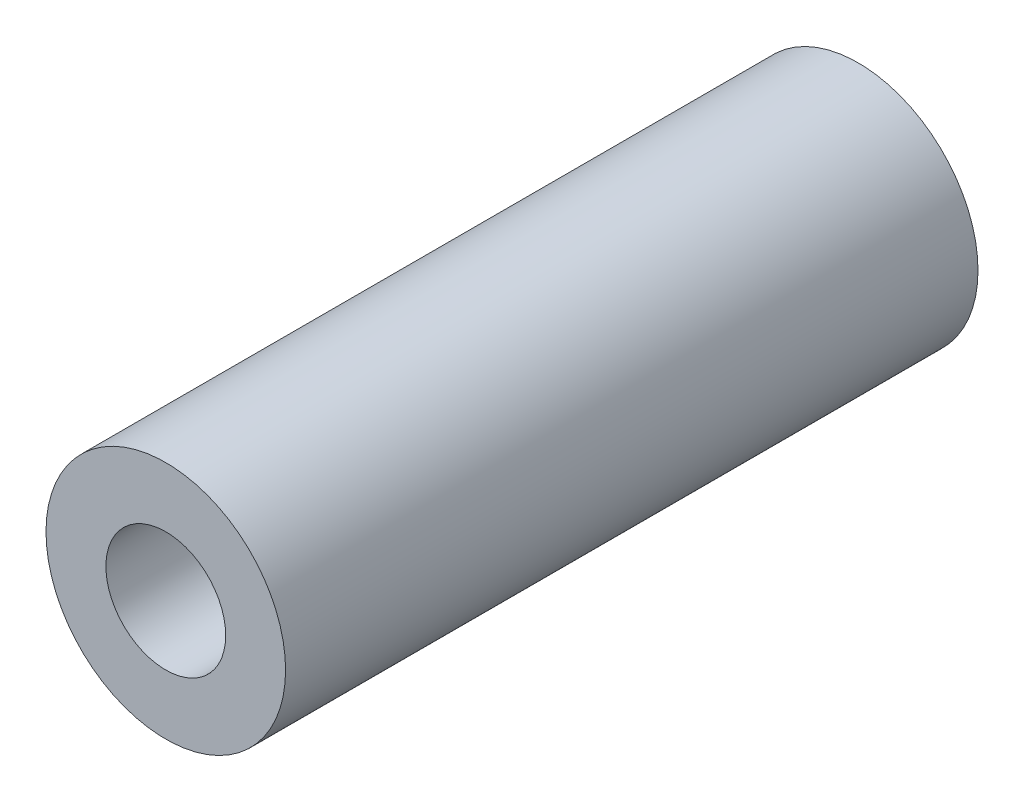
ISO-10303-21;
HEADER;
FILE_DESCRIPTION(('STEP AP214'),'2;1');
FILE_NAME('part.step','',(''),(''),'','','');
FILE_SCHEMA(('AUTOMOTIVE_DESIGN { 1 0 10303 214 1 1 1 1 }'));
ENDSEC;
DATA;
#1=APPLICATION_CONTEXT('core data for automotive mechanical design processes');
#2=APPLICATION_PROTOCOL_DEFINITION('international standard','automotive_design',2000,#1);
#3=PRODUCT_CONTEXT('',#1,'mechanical');
#4=PRODUCT('Part','Part','',(#3));
#5=PRODUCT_RELATED_PRODUCT_CATEGORY('part','',(#4));
#6=PRODUCT_DEFINITION_FORMATION('','',#4);
#7=PRODUCT_DEFINITION_CONTEXT('part definition',#1,'design');
#8=PRODUCT_DEFINITION('design','',#6,#7);
#9=PRODUCT_DEFINITION_SHAPE('','',#8);
#10=(LENGTH_UNIT() NAMED_UNIT(*) SI_UNIT(.MILLI.,.METRE.));
#11=(NAMED_UNIT(*) PLANE_ANGLE_UNIT() SI_UNIT($,.RADIAN.));
#12=(NAMED_UNIT(*) SI_UNIT($,.STERADIAN.) SOLID_ANGLE_UNIT());
#13=UNCERTAINTY_MEASURE_WITH_UNIT(LENGTH_MEASURE(1.E-05),#10,'distance_accuracy_value','');
#14=(GEOMETRIC_REPRESENTATION_CONTEXT(3) GLOBAL_UNCERTAINTY_ASSIGNED_CONTEXT((#13)) GLOBAL_UNIT_ASSIGNED_CONTEXT((#10,
#11,#12)) REPRESENTATION_CONTEXT('',''));
#15=CARTESIAN_POINT('',(0.,0.,0.));
#16=DIRECTION('',(0.,0.,1.));
#17=DIRECTION('',(1.,0.,0.));
#18=AXIS2_PLACEMENT_3D('',#15,#16,#17);
#19=CARTESIAN_POINT('',(0.,0.,28.9));
#20=DIRECTION('',(0.,0.,-1.));
#21=DIRECTION('',(-1.,0.,0.));
#22=AXIS2_PLACEMENT_3D('',#19,#20,#21);
#23=CYLINDRICAL_SURFACE('',#22,5.);
#24=CARTESIAN_POINT('',(0.,0.,28.9));
#25=DIRECTION('',(0.,0.,1.));
#26=DIRECTION('',(1.,0.,0.));
#27=AXIS2_PLACEMENT_3D('',#24,#25,#26);
#28=CIRCLE('',#27,5.);
#29=CARTESIAN_POINT('',(5.,0.,28.9));
#30=VERTEX_POINT('',#29);
#31=EDGE_CURVE('E10',#30,#30,#28,.T.);
#32=ORIENTED_EDGE('',*,*,#31,.F.);
#33=EDGE_LOOP('',(#32));
#34=FACE_BOUND('',#33,.T.);
#35=CARTESIAN_POINT('',(0.,0.,0.));
#36=DIRECTION('',(0.,0.,1.));
#37=DIRECTION('',(1.,0.,0.));
#38=AXIS2_PLACEMENT_3D('',#35,#36,#37);
#39=CIRCLE('',#38,5.);
#40=CARTESIAN_POINT('',(5.,0.,0.));
#41=VERTEX_POINT('',#40);
#42=EDGE_CURVE('E38',#41,#41,#39,.T.);
#43=ORIENTED_EDGE('',*,*,#42,.T.);
#44=EDGE_LOOP('',(#43));
#45=FACE_BOUND('',#44,.T.);
#46=ADVANCED_FACE('F35',(#34,#45),#23,.T.);
#47=CARTESIAN_POINT('',(0.,0.,28.9));
#48=DIRECTION('',(0.,0.,1.));
#49=DIRECTION('',(1.,0.,0.));
#50=AXIS2_PLACEMENT_3D('',#47,#48,#49);
#51=PLANE('',#50);
#52=CARTESIAN_POINT('',(0.,0.,28.9));
#53=DIRECTION('',(0.,0.,1.));
#54=DIRECTION('',(1.,0.,0.));
#55=AXIS2_PLACEMENT_3D('',#52,#53,#54);
#56=CIRCLE('',#55,2.5);
#57=CARTESIAN_POINT('',(2.5,0.,28.9));
#58=VERTEX_POINT('',#57);
#59=EDGE_CURVE('E49',#58,#58,#56,.T.);
#60=ORIENTED_EDGE('',*,*,#59,.F.);
#61=EDGE_LOOP('',(#60));
#62=FACE_BOUND('',#61,.T.);
#63=ORIENTED_EDGE('',*,*,#31,.T.);
#64=EDGE_LOOP('',(#63));
#65=FACE_BOUND('',#64,.T.);
#66=ADVANCED_FACE('F55',(#62,#65),#51,.T.);
#67=CARTESIAN_POINT('',(0.,0.,0.));
#68=DIRECTION('',(0.,0.,1.));
#69=DIRECTION('',(1.,0.,0.));
#70=AXIS2_PLACEMENT_3D('',#67,#68,#69);
#71=PLANE('',#70);
#72=CARTESIAN_POINT('',(0.,0.,0.));
#73=DIRECTION('',(0.,0.,1.));
#74=DIRECTION('',(1.,0.,0.));
#75=AXIS2_PLACEMENT_3D('',#72,#73,#74);
#76=CIRCLE('',#75,2.5);
#77=CARTESIAN_POINT('',(2.5,0.,0.));
#78=VERTEX_POINT('',#77);
#79=EDGE_CURVE('E45',#78,#78,#76,.T.);
#80=ORIENTED_EDGE('',*,*,#79,.T.);
#81=EDGE_LOOP('',(#80));
#82=FACE_BOUND('',#81,.T.);
#83=ORIENTED_EDGE('',*,*,#42,.F.);
#84=EDGE_LOOP('',(#83));
#85=FACE_BOUND('',#84,.T.);
#86=ADVANCED_FACE('F57',(#82,#85),#71,.F.);
#87=CARTESIAN_POINT('',(0.,0.,28.9));
#88=DIRECTION('',(0.,0.,1.));
#89=DIRECTION('',(1.,0.,0.));
#90=AXIS2_PLACEMENT_3D('',#87,#88,#89);
#91=CYLINDRICAL_SURFACE('',#90,2.5);
#92=ORIENTED_EDGE('',*,*,#79,.F.);
#93=EDGE_LOOP('',(#92));
#94=FACE_BOUND('',#93,.T.);
#95=ORIENTED_EDGE('',*,*,#59,.T.);
#96=EDGE_LOOP('',(#95));
#97=FACE_BOUND('',#96,.T.);
#98=ADVANCED_FACE('F53',(#94,#97),#91,.F.);
#99=CLOSED_SHELL('',(#46,#66,#86,#98));
#100=MANIFOLD_SOLID_BREP('B2',#99);
#101=ADVANCED_BREP_SHAPE_REPRESENTATION('',(#18,#100),#14);
#102=SHAPE_DEFINITION_REPRESENTATION(#9,#101);
ENDSEC;
END-ISO-10303-21;
